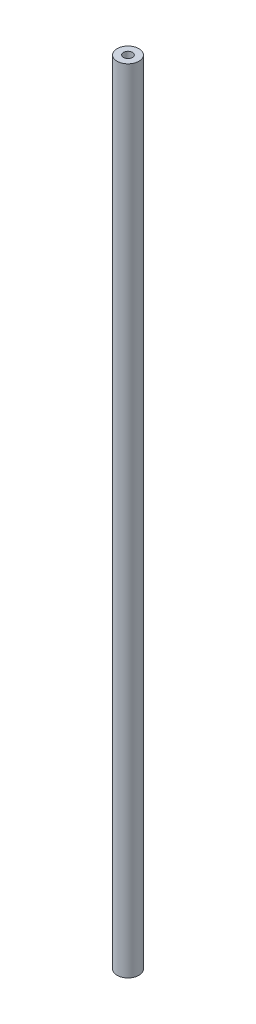
ISO-10303-21;
HEADER;
FILE_DESCRIPTION(('STEP AP214'),'2;1');
FILE_NAME('part.step','',(''),(''),'','','');
FILE_SCHEMA(('AUTOMOTIVE_DESIGN { 1 0 10303 214 1 1 1 1 }'));
ENDSEC;
DATA;
#1=APPLICATION_CONTEXT('core data for automotive mechanical design processes');
#2=APPLICATION_PROTOCOL_DEFINITION('international standard','automotive_design',2000,#1);
#3=PRODUCT_CONTEXT('',#1,'mechanical');
#4=PRODUCT('Part','Part','',(#3));
#5=PRODUCT_RELATED_PRODUCT_CATEGORY('part','',(#4));
#6=PRODUCT_DEFINITION_FORMATION('','',#4);
#7=PRODUCT_DEFINITION_CONTEXT('part definition',#1,'design');
#8=PRODUCT_DEFINITION('design','',#6,#7);
#9=PRODUCT_DEFINITION_SHAPE('','',#8);
#10=(LENGTH_UNIT() NAMED_UNIT(*) SI_UNIT(.MILLI.,.METRE.));
#11=(NAMED_UNIT(*) PLANE_ANGLE_UNIT() SI_UNIT($,.RADIAN.));
#12=(NAMED_UNIT(*) SI_UNIT($,.STERADIAN.) SOLID_ANGLE_UNIT());
#13=UNCERTAINTY_MEASURE_WITH_UNIT(LENGTH_MEASURE(1.E-05),#10,'distance_accuracy_value','');
#14=(GEOMETRIC_REPRESENTATION_CONTEXT(3) GLOBAL_UNCERTAINTY_ASSIGNED_CONTEXT((#13)) GLOBAL_UNIT_ASSIGNED_CONTEXT((#10,
#11,#12)) REPRESENTATION_CONTEXT('',''));
#15=CARTESIAN_POINT('',(0.,0.,0.));
#16=DIRECTION('',(0.,0.,1.));
#17=DIRECTION('',(1.,0.,0.));
#18=AXIS2_PLACEMENT_3D('',#15,#16,#17);
#19=CARTESIAN_POINT('',(0.,290.,0.));
#20=DIRECTION('',(0.,-1.,0.));
#21=DIRECTION('',(0.,0.,-1.));
#22=AXIS2_PLACEMENT_3D('',#19,#20,#21);
#23=CYLINDRICAL_SURFACE('',#22,4.);
#24=CARTESIAN_POINT('',(0.,290.,0.));
#25=DIRECTION('',(0.,1.,0.));
#26=DIRECTION('',(0.,0.,1.));
#27=AXIS2_PLACEMENT_3D('',#24,#25,#26);
#28=CIRCLE('',#27,4.);
#29=CARTESIAN_POINT('',(0.,290.,4.));
#30=VERTEX_POINT('',#29);
#31=EDGE_CURVE('E11',#30,#30,#28,.T.);
#32=ORIENTED_EDGE('',*,*,#31,.F.);
#33=EDGE_LOOP('',(#32));
#34=FACE_BOUND('',#33,.T.);
#35=CARTESIAN_POINT('',(0.,0.,0.));
#36=DIRECTION('',(0.,1.,0.));
#37=DIRECTION('',(0.,0.,1.));
#38=AXIS2_PLACEMENT_3D('',#35,#36,#37);
#39=CIRCLE('',#38,4.);
#40=CARTESIAN_POINT('',(0.,0.,4.));
#41=VERTEX_POINT('',#40);
#42=EDGE_CURVE('E44',#41,#41,#39,.T.);
#43=ORIENTED_EDGE('',*,*,#42,.T.);
#44=EDGE_LOOP('',(#43));
#45=FACE_BOUND('',#44,.T.);
#46=ADVANCED_FACE('F41',(#34,#45),#23,.T.);
#47=CARTESIAN_POINT('',(0.,290.,0.));
#48=DIRECTION('',(0.,1.,0.));
#49=DIRECTION('',(0.,0.,1.));
#50=AXIS2_PLACEMENT_3D('',#47,#48,#49);
#51=PLANE('',#50);
#52=CARTESIAN_POINT('',(0.,290.,0.));
#53=DIRECTION('',(0.,1.,0.));
#54=DIRECTION('',(0.,0.,1.));
#55=AXIS2_PLACEMENT_3D('',#52,#53,#54);
#56=CIRCLE('',#55,1.65);
#57=CARTESIAN_POINT('',(0.,290.,1.65));
#58=VERTEX_POINT('',#57);
#59=EDGE_CURVE('E66',#58,#58,#56,.T.);
#60=ORIENTED_EDGE('',*,*,#59,.F.);
#61=EDGE_LOOP('',(#60));
#62=FACE_BOUND('',#61,.T.);
#63=ORIENTED_EDGE('',*,*,#31,.T.);
#64=EDGE_LOOP('',(#63));
#65=FACE_BOUND('',#64,.T.);
#66=ADVANCED_FACE('F87',(#62,#65),#51,.T.);
#67=CARTESIAN_POINT('',(0.,0.,0.));
#68=DIRECTION('',(0.,1.,0.));
#69=DIRECTION('',(0.,0.,1.));
#70=AXIS2_PLACEMENT_3D('',#67,#68,#69);
#71=PLANE('',#70);
#72=CARTESIAN_POINT('',(0.,0.,0.));
#73=DIRECTION('',(0.,-1.,0.));
#74=DIRECTION('',(0.,0.,-1.));
#75=AXIS2_PLACEMENT_3D('',#72,#73,#74);
#76=CIRCLE('',#75,1.64999999999999);
#77=CARTESIAN_POINT('',(0.,0.,-1.64999999999999));
#78=VERTEX_POINT('',#77);
#79=EDGE_CURVE('E67',#78,#78,#76,.T.);
#80=ORIENTED_EDGE('',*,*,#79,.F.);
#81=EDGE_LOOP('',(#80));
#82=FACE_BOUND('',#81,.T.);
#83=ORIENTED_EDGE('',*,*,#42,.F.);
#84=EDGE_LOOP('',(#83));
#85=FACE_BOUND('',#84,.T.);
#86=ADVANCED_FACE('F84',(#82,#85),#71,.F.);
#87=CARTESIAN_POINT('',(0.,287.6,0.));
#88=DIRECTION('',(0.,1.,0.));
#89=DIRECTION('',(0.,0.,1.));
#90=AXIS2_PLACEMENT_3D('',#87,#88,#89);
#91=CONICAL_SURFACE('',#90,1.65,1.02974425867666);
#92=CARTESIAN_POINT('',(0.,286.608579978604,0.));
#93=VERTEX_POINT('',#92);
#94=VERTEX_LOOP('',#93);
#95=FACE_BOUND('',#94,.T.);
#96=CARTESIAN_POINT('',(0.,287.6,0.));
#97=DIRECTION('',(0.,1.,0.));
#98=DIRECTION('',(0.,0.,1.));
#99=AXIS2_PLACEMENT_3D('',#96,#97,#98);
#100=CIRCLE('',#99,1.65);
#101=CARTESIAN_POINT('',(0.,287.6,1.65));
#102=VERTEX_POINT('',#101);
#103=EDGE_CURVE('E71',#102,#102,#100,.T.);
#104=ORIENTED_EDGE('',*,*,#103,.T.);
#105=EDGE_LOOP('',(#104));
#106=FACE_BOUND('',#105,.T.);
#107=ADVANCED_FACE('F86',(#95,#106),#91,.F.);
#108=CARTESIAN_POINT('',(0.,290.,0.));
#109=DIRECTION('',(0.,1.,0.));
#110=DIRECTION('',(0.,0.,1.));
#111=AXIS2_PLACEMENT_3D('',#108,#109,#110);
#112=CYLINDRICAL_SURFACE('',#111,1.65);
#113=ORIENTED_EDGE('',*,*,#103,.F.);
#114=EDGE_LOOP('',(#113));
#115=FACE_BOUND('',#114,.T.);
#116=ORIENTED_EDGE('',*,*,#59,.T.);
#117=EDGE_LOOP('',(#116));
#118=FACE_BOUND('',#117,.T.);
#119=ADVANCED_FACE('F60',(#115,#118),#112,.F.);
#120=CARTESIAN_POINT('',(0.,2.4,0.));
#121=DIRECTION('',(0.,-1.,0.));
#122=DIRECTION('',(0.,0.,-1.));
#123=AXIS2_PLACEMENT_3D('',#120,#121,#122);
#124=CONICAL_SURFACE('',#123,1.64999999999999,1.02974425867665);
#125=CARTESIAN_POINT('',(0.,3.39142002139547,0.));
#126=VERTEX_POINT('',#125);
#127=VERTEX_LOOP('',#126);
#128=FACE_BOUND('',#127,.T.);
#129=CARTESIAN_POINT('',(0.,2.4,0.));
#130=DIRECTION('',(0.,-1.,0.));
#131=DIRECTION('',(0.,0.,-1.));
#132=AXIS2_PLACEMENT_3D('',#129,#130,#131);
#133=CIRCLE('',#132,1.64999999999999);
#134=CARTESIAN_POINT('',(0.,2.4,-1.64999999999999));
#135=VERTEX_POINT('',#134);
#136=EDGE_CURVE('E64',#135,#135,#133,.T.);
#137=ORIENTED_EDGE('',*,*,#136,.T.);
#138=EDGE_LOOP('',(#137));
#139=FACE_BOUND('',#138,.T.);
#140=ADVANCED_FACE('F56',(#128,#139),#124,.F.);
#141=CARTESIAN_POINT('',(0.,0.,0.));
#142=DIRECTION('',(0.,-1.,0.));
#143=DIRECTION('',(0.,0.,-1.));
#144=AXIS2_PLACEMENT_3D('',#141,#142,#143);
#145=CYLINDRICAL_SURFACE('',#144,1.64999999999999);
#146=ORIENTED_EDGE('',*,*,#136,.F.);
#147=EDGE_LOOP('',(#146));
#148=FACE_BOUND('',#147,.T.);
#149=ORIENTED_EDGE('',*,*,#79,.T.);
#150=EDGE_LOOP('',(#149));
#151=FACE_BOUND('',#150,.T.);
#152=ADVANCED_FACE('F59',(#148,#151),#145,.F.);
#153=CLOSED_SHELL('',(#46,#66,#86,#107,#119,#140,#152));
#154=MANIFOLD_SOLID_BREP('B2',#153);
#155=ADVANCED_BREP_SHAPE_REPRESENTATION('',(#18,#154),#14);
#156=SHAPE_DEFINITION_REPRESENTATION(#9,#155);
ENDSEC;
END-ISO-10303-21;
